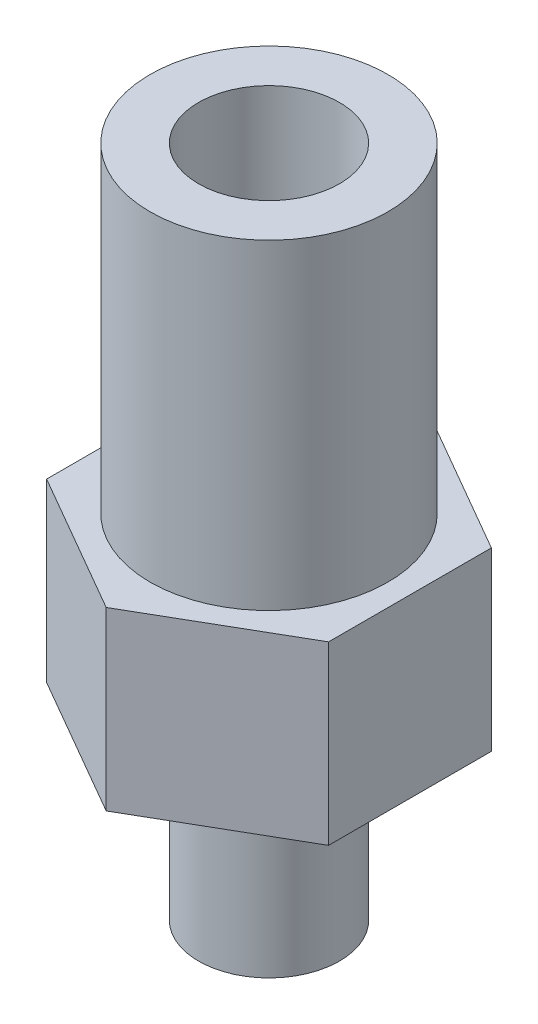
ISO-10303-21;
HEADER;
FILE_DESCRIPTION(('STEP AP214'),'2;1');
FILE_NAME('part.step','',(''),(''),'','','');
FILE_SCHEMA(('AUTOMOTIVE_DESIGN { 1 0 10303 214 1 1 1 1 }'));
ENDSEC;
DATA;
#1=APPLICATION_CONTEXT('core data for automotive mechanical design processes');
#2=APPLICATION_PROTOCOL_DEFINITION('international standard','automotive_design',2000,#1);
#3=PRODUCT_CONTEXT('',#1,'mechanical');
#4=PRODUCT('Part','Part','',(#3));
#5=PRODUCT_RELATED_PRODUCT_CATEGORY('part','',(#4));
#6=PRODUCT_DEFINITION_FORMATION('','',#4);
#7=PRODUCT_DEFINITION_CONTEXT('part definition',#1,'design');
#8=PRODUCT_DEFINITION('design','',#6,#7);
#9=PRODUCT_DEFINITION_SHAPE('','',#8);
#10=(LENGTH_UNIT() NAMED_UNIT(*) SI_UNIT(.MILLI.,.METRE.));
#11=(NAMED_UNIT(*) PLANE_ANGLE_UNIT() SI_UNIT($,.RADIAN.));
#12=(NAMED_UNIT(*) SI_UNIT($,.STERADIAN.) SOLID_ANGLE_UNIT());
#13=UNCERTAINTY_MEASURE_WITH_UNIT(LENGTH_MEASURE(1.E-05),#10,'distance_accuracy_value','');
#14=(GEOMETRIC_REPRESENTATION_CONTEXT(3) GLOBAL_UNCERTAINTY_ASSIGNED_CONTEXT((#13)) GLOBAL_UNIT_ASSIGNED_CONTEXT((#10,
#11,#12)) REPRESENTATION_CONTEXT('',''));
#15=CARTESIAN_POINT('',(0.,0.,0.));
#16=DIRECTION('',(0.,0.,1.));
#17=DIRECTION('',(1.,0.,0.));
#18=AXIS2_PLACEMENT_3D('',#15,#16,#17);
#19=CARTESIAN_POINT('',(0.,10.,9.237604307034));
#20=DIRECTION('',(-0.500000000000007,0.,-0.866025403784435));
#21=DIRECTION('',(-0.866025403784435,0.,0.500000000000007));
#22=AXIS2_PLACEMENT_3D('',#19,#20,#21);
#23=PLANE('',#22);
#24=DIRECTION('',(0.866025403784435,0.,-0.500000000000007));
#25=VECTOR('',#24,1.);
#26=CARTESIAN_POINT('',(0.,0.,9.237604307034));
#27=LINE('',#26,#25);
#28=CARTESIAN_POINT('',(0.,0.,9.237604307034));
#29=VERTEX_POINT('',#28);
#30=CARTESIAN_POINT('',(8.00000000000003,0.,4.61880215351692));
#31=VERTEX_POINT('',#30);
#32=EDGE_CURVE('E121',#29,#31,#27,.T.);
#33=ORIENTED_EDGE('',*,*,#32,.T.);
#34=DIRECTION('',(0.,-1.,0.));
#35=VECTOR('',#34,1.);
#36=CARTESIAN_POINT('',(8.00000000000003,10.,4.61880215351692));
#37=LINE('',#36,#35);
#38=CARTESIAN_POINT('',(8.00000000000003,10.,4.61880215351692));
#39=VERTEX_POINT('',#38);
#40=EDGE_CURVE('E37',#39,#31,#37,.T.);
#41=ORIENTED_EDGE('',*,*,#40,.F.);
#42=DIRECTION('',(0.866025403784435,0.,-0.500000000000007));
#43=VECTOR('',#42,1.);
#44=CARTESIAN_POINT('',(0.,10.,9.237604307034));
#45=LINE('',#44,#43);
#46=CARTESIAN_POINT('',(0.,10.,9.237604307034));
#47=VERTEX_POINT('',#46);
#48=EDGE_CURVE('E132',#47,#39,#45,.T.);
#49=ORIENTED_EDGE('',*,*,#48,.F.);
#50=DIRECTION('',(0.,-1.,0.));
#51=VECTOR('',#50,1.);
#52=CARTESIAN_POINT('',(0.,10.,9.237604307034));
#53=LINE('',#52,#51);
#54=EDGE_CURVE('E117',#47,#29,#53,.T.);
#55=ORIENTED_EDGE('',*,*,#54,.T.);
#56=EDGE_LOOP('',(#33,#41,#49,#55));
#57=FACE_BOUND('',#56,.T.);
#58=ADVANCED_FACE('F34',(#57),#23,.F.);
#59=CARTESIAN_POINT('',(8.00000000000003,10.,4.61880215351692));
#60=DIRECTION('',(-1.,0.,0.));
#61=DIRECTION('',(0.,0.,1.));
#62=AXIS2_PLACEMENT_3D('',#59,#60,#61);
#63=PLANE('',#62);
#64=DIRECTION('',(0.,0.,-1.));
#65=VECTOR('',#64,1.);
#66=CARTESIAN_POINT('',(8.00000000000003,0.,4.61880215351692));
#67=LINE('',#66,#65);
#68=CARTESIAN_POINT('',(7.99999999999993,0.,-4.61880215351709));
#69=VERTEX_POINT('',#68);
#70=EDGE_CURVE('E124',#31,#69,#67,.T.);
#71=ORIENTED_EDGE('',*,*,#70,.T.);
#72=DIRECTION('',(0.,-1.,0.));
#73=VECTOR('',#72,1.);
#74=CARTESIAN_POINT('',(7.99999999999993,10.,-4.61880215351709));
#75=LINE('',#74,#73);
#76=CARTESIAN_POINT('',(7.99999999999993,10.,-4.61880215351709));
#77=VERTEX_POINT('',#76);
#78=EDGE_CURVE('E135',#77,#69,#75,.T.);
#79=ORIENTED_EDGE('',*,*,#78,.F.);
#80=DIRECTION('',(0.,0.,-1.));
#81=VECTOR('',#80,1.);
#82=CARTESIAN_POINT('',(8.00000000000003,10.,4.61880215351692));
#83=LINE('',#82,#81);
#84=EDGE_CURVE('E90',#39,#77,#83,.T.);
#85=ORIENTED_EDGE('',*,*,#84,.F.);
#86=ORIENTED_EDGE('',*,*,#40,.T.);
#87=EDGE_LOOP('',(#71,#79,#85,#86));
#88=FACE_BOUND('',#87,.T.);
#89=ADVANCED_FACE('F148',(#88),#63,.F.);
#90=CARTESIAN_POINT('',(7.99999999999993,10.,-4.61880215351709));
#91=DIRECTION('',(-0.499999999999995,0.,0.866025403784442));
#92=DIRECTION('',(0.866025403784442,0.,0.499999999999995));
#93=AXIS2_PLACEMENT_3D('',#90,#91,#92);
#94=PLANE('',#93);
#95=DIRECTION('',(-0.866025403784442,0.,-0.499999999999995));
#96=VECTOR('',#95,1.);
#97=CARTESIAN_POINT('',(7.99999999999993,0.,-4.61880215351709));
#98=LINE('',#97,#96);
#99=CARTESIAN_POINT('',(0.,0.,-9.237604307034));
#100=VERTEX_POINT('',#99);
#101=EDGE_CURVE('E127',#69,#100,#98,.T.);
#102=ORIENTED_EDGE('',*,*,#101,.T.);
#103=DIRECTION('',(0.,-1.,0.));
#104=VECTOR('',#103,1.);
#105=CARTESIAN_POINT('',(0.,10.,-9.237604307034));
#106=LINE('',#105,#104);
#107=CARTESIAN_POINT('',(0.,10.,-9.237604307034));
#108=VERTEX_POINT('',#107);
#109=EDGE_CURVE('E112',#108,#100,#106,.T.);
#110=ORIENTED_EDGE('',*,*,#109,.F.);
#111=DIRECTION('',(-0.866025403784442,0.,-0.499999999999995));
#112=VECTOR('',#111,1.);
#113=CARTESIAN_POINT('',(7.99999999999993,10.,-4.61880215351709));
#114=LINE('',#113,#112);
#115=EDGE_CURVE('E103',#77,#108,#114,.T.);
#116=ORIENTED_EDGE('',*,*,#115,.F.);
#117=ORIENTED_EDGE('',*,*,#78,.T.);
#118=EDGE_LOOP('',(#102,#110,#116,#117));
#119=FACE_BOUND('',#118,.T.);
#120=ADVANCED_FACE('F149',(#119),#94,.F.);
#121=CARTESIAN_POINT('',(0.,10.,-9.237604307034));
#122=DIRECTION('',(0.500000000000001,0.,0.866025403784438));
#123=DIRECTION('',(0.866025403784438,0.,-0.500000000000001));
#124=AXIS2_PLACEMENT_3D('',#121,#122,#123);
#125=PLANE('',#124);
#126=DIRECTION('',(-0.866025403784438,0.,0.500000000000001));
#127=VECTOR('',#126,1.);
#128=CARTESIAN_POINT('',(0.,0.,-9.237604307034));
#129=LINE('',#128,#127);
#130=CARTESIAN_POINT('',(-8.,0.,-4.61880215351698));
#131=VERTEX_POINT('',#130);
#132=EDGE_CURVE('E111',#100,#131,#129,.T.);
#133=ORIENTED_EDGE('',*,*,#132,.T.);
#134=DIRECTION('',(0.,-1.,0.));
#135=VECTOR('',#134,1.);
#136=CARTESIAN_POINT('',(-8.,10.,-4.61880215351698));
#137=LINE('',#136,#135);
#138=CARTESIAN_POINT('',(-8.,10.,-4.61880215351698));
#139=VERTEX_POINT('',#138);
#140=EDGE_CURVE('E108',#139,#131,#137,.T.);
#141=ORIENTED_EDGE('',*,*,#140,.F.);
#142=DIRECTION('',(-0.866025403784438,0.,0.500000000000001));
#143=VECTOR('',#142,1.);
#144=CARTESIAN_POINT('',(0.,10.,-9.237604307034));
#145=LINE('',#144,#143);
#146=EDGE_CURVE('E97',#108,#139,#145,.T.);
#147=ORIENTED_EDGE('',*,*,#146,.F.);
#148=ORIENTED_EDGE('',*,*,#109,.T.);
#149=EDGE_LOOP('',(#133,#141,#147,#148));
#150=FACE_BOUND('',#149,.T.);
#151=ADVANCED_FACE('F109',(#150),#125,.F.);
#152=CARTESIAN_POINT('',(-8.,10.,-4.61880215351698));
#153=DIRECTION('',(1.,0.,0.));
#154=DIRECTION('',(0.,0.,-1.));
#155=AXIS2_PLACEMENT_3D('',#152,#153,#154);
#156=PLANE('',#155);
#157=DIRECTION('',(0.,0.,1.));
#158=VECTOR('',#157,1.);
#159=CARTESIAN_POINT('',(-8.,0.,-4.61880215351698));
#160=LINE('',#159,#158);
#161=CARTESIAN_POINT('',(-7.99999999999997,0.,4.61880215351704));
#162=VERTEX_POINT('',#161);
#163=EDGE_CURVE('E75',#131,#162,#160,.T.);
#164=ORIENTED_EDGE('',*,*,#163,.T.);
#165=DIRECTION('',(0.,-1.,0.));
#166=VECTOR('',#165,1.);
#167=CARTESIAN_POINT('',(-7.99999999999997,10.,4.61880215351704));
#168=LINE('',#167,#166);
#169=CARTESIAN_POINT('',(-7.99999999999997,10.,4.61880215351704));
#170=VERTEX_POINT('',#169);
#171=EDGE_CURVE('E113',#170,#162,#168,.T.);
#172=ORIENTED_EDGE('',*,*,#171,.F.);
#173=DIRECTION('',(0.,0.,1.));
#174=VECTOR('',#173,1.);
#175=CARTESIAN_POINT('',(-8.,10.,-4.61880215351698));
#176=LINE('',#175,#174);
#177=EDGE_CURVE('E101',#139,#170,#176,.T.);
#178=ORIENTED_EDGE('',*,*,#177,.F.);
#179=ORIENTED_EDGE('',*,*,#140,.T.);
#180=EDGE_LOOP('',(#164,#172,#178,#179));
#181=FACE_BOUND('',#180,.T.);
#182=ADVANCED_FACE('F115',(#181),#156,.F.);
#183=CARTESIAN_POINT('',(-7.99999999999997,10.,4.61880215351704));
#184=DIRECTION('',(0.499999999999995,0.,-0.866025403784442));
#185=DIRECTION('',(-0.866025403784442,0.,-0.499999999999995));
#186=AXIS2_PLACEMENT_3D('',#183,#184,#185);
#187=PLANE('',#186);
#188=DIRECTION('',(0.866025403784441,0.,0.499999999999995));
#189=VECTOR('',#188,1.);
#190=CARTESIAN_POINT('',(-7.99999999999997,0.,4.61880215351704));
#191=LINE('',#190,#189);
#192=EDGE_CURVE('E81',#162,#29,#191,.T.);
#193=ORIENTED_EDGE('',*,*,#192,.T.);
#194=ORIENTED_EDGE('',*,*,#54,.F.);
#195=DIRECTION('',(0.866025403784441,0.,0.499999999999995));
#196=VECTOR('',#195,1.);
#197=CARTESIAN_POINT('',(-7.99999999999997,10.,4.61880215351704));
#198=LINE('',#197,#196);
#199=EDGE_CURVE('E52',#170,#47,#198,.T.);
#200=ORIENTED_EDGE('',*,*,#199,.F.);
#201=ORIENTED_EDGE('',*,*,#171,.T.);
#202=EDGE_LOOP('',(#193,#194,#200,#201));
#203=FACE_BOUND('',#202,.T.);
#204=ADVANCED_FACE('F154',(#203),#187,.F.);
#205=CARTESIAN_POINT('',(0.,10.,0.));
#206=DIRECTION('',(0.,1.,0.));
#207=DIRECTION('',(0.,0.,1.));
#208=AXIS2_PLACEMENT_3D('',#205,#206,#207);
#209=PLANE('',#208);
#210=CARTESIAN_POINT('',(0.,10.,0.));
#211=DIRECTION('',(0.,1.,0.));
#212=DIRECTION('',(0.,0.,1.));
#213=AXIS2_PLACEMENT_3D('',#210,#211,#212);
#214=CIRCLE('',#213,6.75);
#215=CARTESIAN_POINT('',(0.,10.,6.75));
#216=VERTEX_POINT('',#215);
#217=EDGE_CURVE('E43',#216,#216,#214,.T.);
#218=ORIENTED_EDGE('',*,*,#217,.F.);
#219=EDGE_LOOP('',(#218));
#220=FACE_BOUND('',#219,.T.);
#221=ORIENTED_EDGE('',*,*,#48,.T.);
#222=ORIENTED_EDGE('',*,*,#84,.T.);
#223=ORIENTED_EDGE('',*,*,#115,.T.);
#224=ORIENTED_EDGE('',*,*,#146,.T.);
#225=ORIENTED_EDGE('',*,*,#177,.T.);
#226=ORIENTED_EDGE('',*,*,#199,.T.);
#227=EDGE_LOOP('',(#221,#222,#223,#224,#225,#226));
#228=FACE_BOUND('',#227,.T.);
#229=ADVANCED_FACE('F99',(#220,#228),#209,.T.);
#230=CARTESIAN_POINT('',(0.,0.,0.));
#231=DIRECTION('',(0.,1.,0.));
#232=DIRECTION('',(0.,0.,1.));
#233=AXIS2_PLACEMENT_3D('',#230,#231,#232);
#234=PLANE('',#233);
#235=CARTESIAN_POINT('',(0.,0.,0.));
#236=DIRECTION('',(0.,-1.,0.));
#237=DIRECTION('',(0.,0.,-1.));
#238=AXIS2_PLACEMENT_3D('',#235,#236,#237);
#239=CIRCLE('',#238,4.);
#240=CARTESIAN_POINT('',(0.,0.,-4.));
#241=VERTEX_POINT('',#240);
#242=EDGE_CURVE('E11',#241,#241,#239,.T.);
#243=ORIENTED_EDGE('',*,*,#242,.F.);
#244=EDGE_LOOP('',(#243));
#245=FACE_BOUND('',#244,.T.);
#246=ORIENTED_EDGE('',*,*,#32,.F.);
#247=ORIENTED_EDGE('',*,*,#192,.F.);
#248=ORIENTED_EDGE('',*,*,#163,.F.);
#249=ORIENTED_EDGE('',*,*,#132,.F.);
#250=ORIENTED_EDGE('',*,*,#101,.F.);
#251=ORIENTED_EDGE('',*,*,#70,.F.);
#252=EDGE_LOOP('',(#246,#247,#248,#249,#250,#251));
#253=FACE_BOUND('',#252,.T.);
#254=ADVANCED_FACE('F152',(#245,#253),#234,.F.);
#255=CARTESIAN_POINT('',(0.,28.2,0.));
#256=DIRECTION('',(0.,-1.,0.));
#257=DIRECTION('',(0.,0.,-1.));
#258=AXIS2_PLACEMENT_3D('',#255,#256,#257);
#259=CYLINDRICAL_SURFACE('',#258,6.75);
#260=CARTESIAN_POINT('',(0.,28.2,0.));
#261=DIRECTION('',(0.,1.,0.));
#262=DIRECTION('',(0.,0.,1.));
#263=AXIS2_PLACEMENT_3D('',#260,#261,#262);
#264=CIRCLE('',#263,6.75);
#265=CARTESIAN_POINT('',(0.,28.2,6.75));
#266=VERTEX_POINT('',#265);
#267=EDGE_CURVE('E125',#266,#266,#264,.T.);
#268=ORIENTED_EDGE('',*,*,#267,.F.);
#269=EDGE_LOOP('',(#268));
#270=FACE_BOUND('',#269,.T.);
#271=ORIENTED_EDGE('',*,*,#217,.T.);
#272=EDGE_LOOP('',(#271));
#273=FACE_BOUND('',#272,.T.);
#274=ADVANCED_FACE('F200',(#270,#273),#259,.T.);
#275=CARTESIAN_POINT('',(0.,28.2,0.));
#276=DIRECTION('',(0.,1.,0.));
#277=DIRECTION('',(0.,0.,1.));
#278=AXIS2_PLACEMENT_3D('',#275,#276,#277);
#279=PLANE('',#278);
#280=CARTESIAN_POINT('',(0.,28.2,0.));
#281=DIRECTION('',(0.,1.,0.));
#282=DIRECTION('',(0.,0.,1.));
#283=AXIS2_PLACEMENT_3D('',#280,#281,#282);
#284=CIRCLE('',#283,4.);
#285=CARTESIAN_POINT('',(0.,28.2,4.));
#286=VERTEX_POINT('',#285);
#287=EDGE_CURVE('E269',#286,#286,#284,.T.);
#288=ORIENTED_EDGE('',*,*,#287,.F.);
#289=EDGE_LOOP('',(#288));
#290=FACE_BOUND('',#289,.T.);
#291=ORIENTED_EDGE('',*,*,#267,.T.);
#292=EDGE_LOOP('',(#291));
#293=FACE_BOUND('',#292,.T.);
#294=ADVANCED_FACE('F205',(#290,#293),#279,.T.);
#295=CARTESIAN_POINT('',(0.,-10.,0.));
#296=DIRECTION('',(0.,1.,0.));
#297=DIRECTION('',(0.,0.,1.));
#298=AXIS2_PLACEMENT_3D('',#295,#296,#297);
#299=CYLINDRICAL_SURFACE('',#298,4.);
#300=CARTESIAN_POINT('',(0.,-10.,0.));
#301=DIRECTION('',(0.,-1.,0.));
#302=DIRECTION('',(0.,0.,-1.));
#303=AXIS2_PLACEMENT_3D('',#300,#301,#302);
#304=CIRCLE('',#303,4.);
#305=CARTESIAN_POINT('',(0.,-10.,-4.));
#306=VERTEX_POINT('',#305);
#307=EDGE_CURVE('E268',#306,#306,#304,.T.);
#308=ORIENTED_EDGE('',*,*,#307,.F.);
#309=EDGE_LOOP('',(#308));
#310=FACE_BOUND('',#309,.T.);
#311=ORIENTED_EDGE('',*,*,#242,.T.);
#312=EDGE_LOOP('',(#311));
#313=FACE_BOUND('',#312,.T.);
#314=ADVANCED_FACE('F219',(#310,#313),#299,.T.);
#315=CARTESIAN_POINT('',(0.,-10.,0.));
#316=DIRECTION('',(0.,-1.,0.));
#317=DIRECTION('',(0.,0.,-1.));
#318=AXIS2_PLACEMENT_3D('',#315,#316,#317);
#319=PLANE('',#318);
#320=ORIENTED_EDGE('',*,*,#307,.T.);
#321=EDGE_LOOP('',(#320));
#322=FACE_BOUND('',#321,.T.);
#323=ADVANCED_FACE('F224',(#322),#319,.T.);
#324=CARTESIAN_POINT('',(0.,1.8,0.));
#325=DIRECTION('',(0.,1.,0.));
#326=DIRECTION('',(0.,0.,1.));
#327=AXIS2_PLACEMENT_3D('',#324,#325,#326);
#328=CYLINDRICAL_SURFACE('',#327,4.);
#329=CARTESIAN_POINT('',(0.,1.8,0.));
#330=DIRECTION('',(0.,1.,0.));
#331=DIRECTION('',(0.,0.,1.));
#332=AXIS2_PLACEMENT_3D('',#329,#330,#331);
#333=CIRCLE('',#332,4.);
#334=CARTESIAN_POINT('',(0.,1.8,4.));
#335=VERTEX_POINT('',#334);
#336=EDGE_CURVE('E267',#335,#335,#333,.T.);
#337=ORIENTED_EDGE('',*,*,#336,.F.);
#338=EDGE_LOOP('',(#337));
#339=FACE_BOUND('',#338,.T.);
#340=ORIENTED_EDGE('',*,*,#287,.T.);
#341=EDGE_LOOP('',(#340));
#342=FACE_BOUND('',#341,.T.);
#343=ADVANCED_FACE('F234',(#339,#342),#328,.F.);
#344=CARTESIAN_POINT('',(0.,1.8,0.));
#345=DIRECTION('',(0.,1.,0.));
#346=DIRECTION('',(0.,0.,1.));
#347=AXIS2_PLACEMENT_3D('',#344,#345,#346);
#348=PLANE('',#347);
#349=ORIENTED_EDGE('',*,*,#336,.T.);
#350=EDGE_LOOP('',(#349));
#351=FACE_BOUND('',#350,.T.);
#352=ADVANCED_FACE('F251',(#351),#348,.T.);
#353=CLOSED_SHELL('',(#58,#89,#120,#151,#182,#204,#229,#254,#274,#294,#314,#323,#343,#352));
#354=MANIFOLD_SOLID_BREP('B2',#353);
#355=ADVANCED_BREP_SHAPE_REPRESENTATION('',(#18,#354),#14);
#356=SHAPE_DEFINITION_REPRESENTATION(#9,#355);
ENDSEC;
END-ISO-10303-21;
